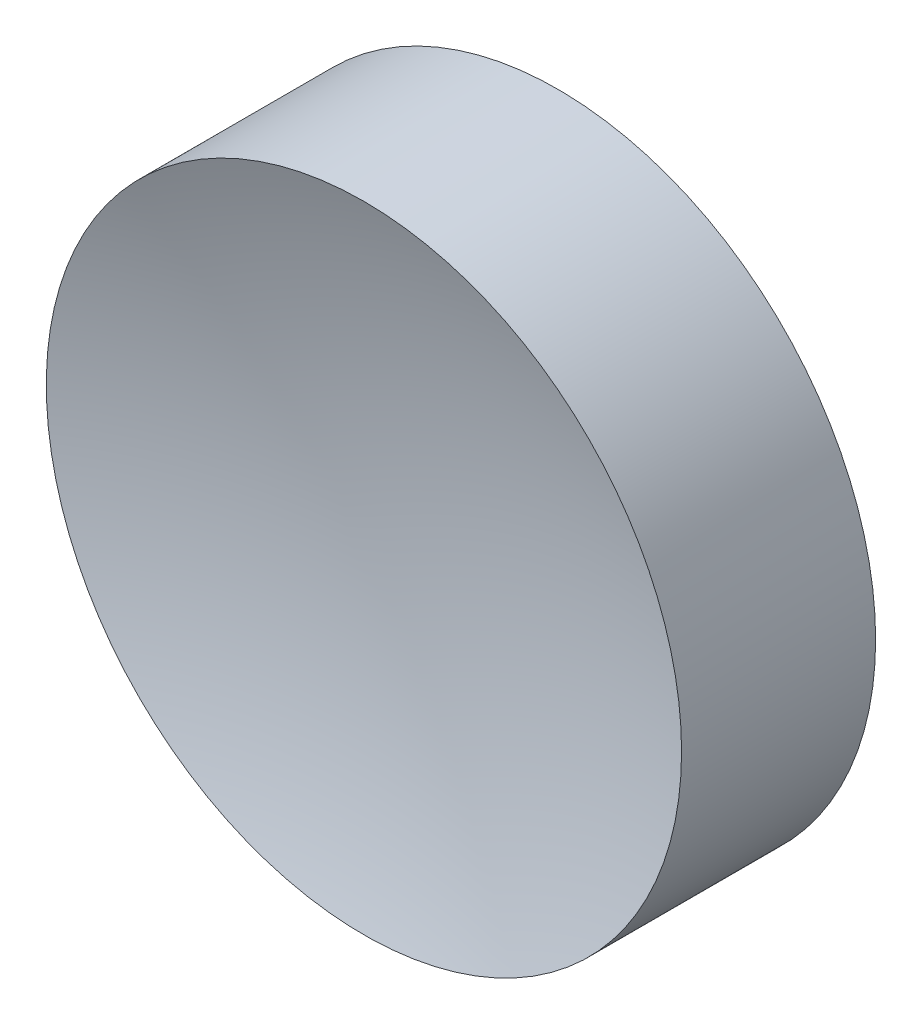
ISO-10303-21;
HEADER;
FILE_DESCRIPTION(('STEP AP214'),'2;1');
FILE_NAME('part.step','',(''),(''),'','','');
FILE_SCHEMA(('AUTOMOTIVE_DESIGN { 1 0 10303 214 1 1 1 1 }'));
ENDSEC;
DATA;
#1=APPLICATION_CONTEXT('core data for automotive mechanical design processes');
#2=APPLICATION_PROTOCOL_DEFINITION('international standard','automotive_design',2000,#1);
#3=PRODUCT_CONTEXT('',#1,'mechanical');
#4=PRODUCT('Part','Part','',(#3));
#5=PRODUCT_RELATED_PRODUCT_CATEGORY('part','',(#4));
#6=PRODUCT_DEFINITION_FORMATION('','',#4);
#7=PRODUCT_DEFINITION_CONTEXT('part definition',#1,'design');
#8=PRODUCT_DEFINITION('design','',#6,#7);
#9=PRODUCT_DEFINITION_SHAPE('','',#8);
#10=(LENGTH_UNIT() NAMED_UNIT(*) SI_UNIT(.MILLI.,.METRE.));
#11=(NAMED_UNIT(*) PLANE_ANGLE_UNIT() SI_UNIT($,.RADIAN.));
#12=(NAMED_UNIT(*) SI_UNIT($,.STERADIAN.) SOLID_ANGLE_UNIT());
#13=UNCERTAINTY_MEASURE_WITH_UNIT(LENGTH_MEASURE(1.E-05),#10,'distance_accuracy_value','');
#14=(GEOMETRIC_REPRESENTATION_CONTEXT(3) GLOBAL_UNCERTAINTY_ASSIGNED_CONTEXT((#13)) GLOBAL_UNIT_ASSIGNED_CONTEXT((#10,
#11,#12)) REPRESENTATION_CONTEXT('',''));
#15=CARTESIAN_POINT('',(0.,0.,0.));
#16=DIRECTION('',(0.,0.,1.));
#17=DIRECTION('',(1.,0.,0.));
#18=AXIS2_PLACEMENT_3D('',#15,#16,#17);
#19=CARTESIAN_POINT('',(0.,0.,14.5154280682464));
#20=DIRECTION('',(0.,0.,1.));
#21=DIRECTION('',(0.,1.,0.));
#22=AXIS2_PLACEMENT_3D('',#19,#20,#21);
#23=SPHERICAL_SURFACE('',#22,13.89);
#24=CARTESIAN_POINT('',(0.,0.,1.37457193175361));
#25=DIRECTION('',(0.,0.,1.));
#26=DIRECTION('',(1.,0.,0.));
#27=AXIS2_PLACEMENT_3D('',#24,#25,#26);
#28=CIRCLE('',#27,4.5);
#29=CARTESIAN_POINT('',(4.5,0.,1.37457193175361));
#30=VERTEX_POINT('',#29);
#31=EDGE_CURVE('E18',#30,#30,#28,.T.);
#32=ORIENTED_EDGE('',*,*,#31,.T.);
#33=EDGE_LOOP('',(#32));
#34=FACE_BOUND('',#33,.T.);
#35=ADVANCED_FACE('F12',(#34),#23,.F.);
#36=CARTESIAN_POINT('',(0.,0.,-1.37457193175361));
#37=DIRECTION('',(0.,0.,1.));
#38=DIRECTION('',(1.,0.,0.));
#39=AXIS2_PLACEMENT_3D('',#36,#37,#38);
#40=PLANE('',#39);
#41=CARTESIAN_POINT('',(0.,0.,-1.37457193175361));
#42=DIRECTION('',(0.,0.,1.));
#43=DIRECTION('',(1.,0.,0.));
#44=AXIS2_PLACEMENT_3D('',#41,#42,#43);
#45=CIRCLE('',#44,4.5);
#46=CARTESIAN_POINT('',(4.5,0.,-1.37457193175361));
#47=VERTEX_POINT('',#46);
#48=EDGE_CURVE('E8',#47,#47,#45,.T.);
#49=ORIENTED_EDGE('',*,*,#48,.F.);
#50=EDGE_LOOP('',(#49));
#51=FACE_BOUND('',#50,.T.);
#52=ADVANCED_FACE('F27',(#51),#40,.F.);
#53=CARTESIAN_POINT('',(0.,0.,8.64258133867572));
#54=DIRECTION('',(0.,0.,1.));
#55=DIRECTION('',(1.,0.,0.));
#56=AXIS2_PLACEMENT_3D('',#53,#54,#55);
#57=CYLINDRICAL_SURFACE('',#56,4.5);
#58=ORIENTED_EDGE('',*,*,#31,.F.);
#59=EDGE_LOOP('',(#58));
#60=FACE_BOUND('',#59,.T.);
#61=ORIENTED_EDGE('',*,*,#48,.T.);
#62=EDGE_LOOP('',(#61));
#63=FACE_BOUND('',#62,.T.);
#64=ADVANCED_FACE('F25',(#60,#63),#57,.T.);
#65=CLOSED_SHELL('',(#35,#52,#64));
#66=MANIFOLD_SOLID_BREP('B1',#65);
#67=ADVANCED_BREP_SHAPE_REPRESENTATION('',(#18,#66),#14);
#68=SHAPE_DEFINITION_REPRESENTATION(#9,#67);
ENDSEC;
END-ISO-10303-21;
